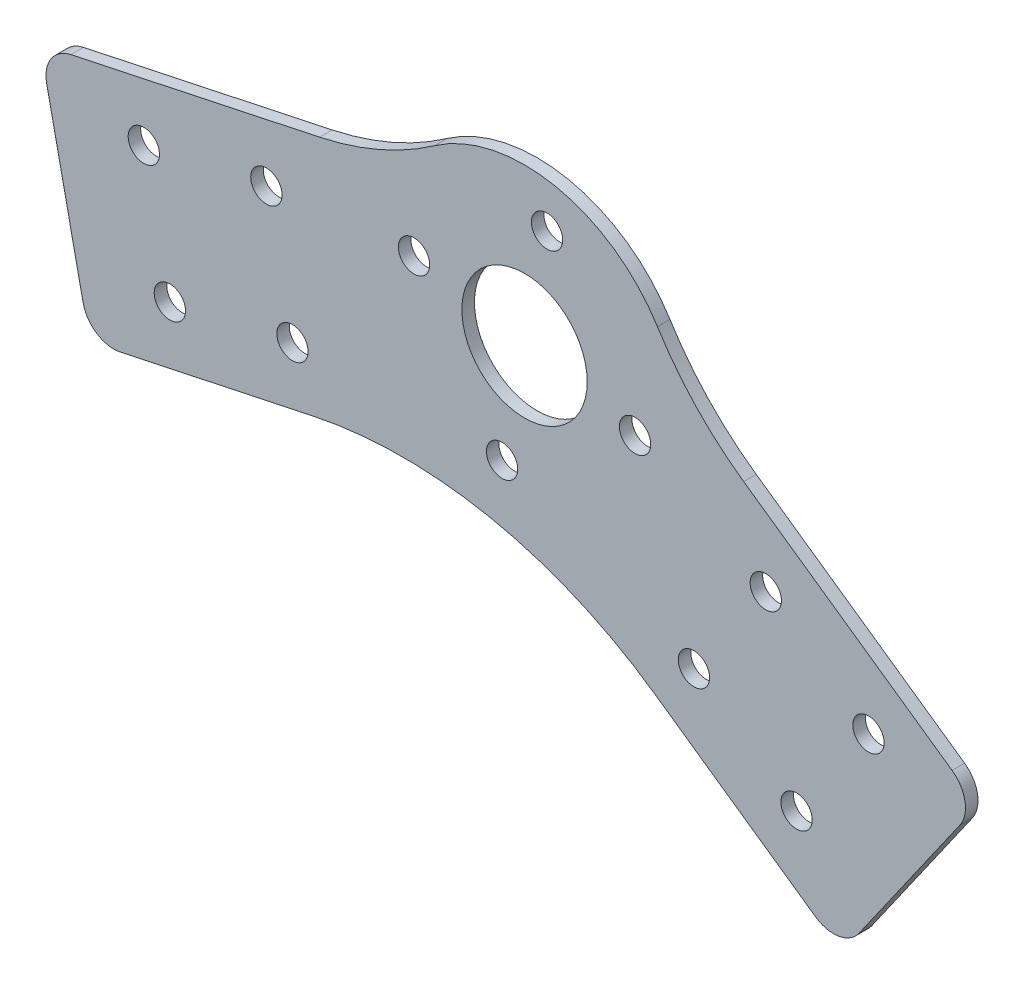
ISO-10303-21;
HEADER;
FILE_DESCRIPTION(('STEP AP214'),'2;1');
FILE_NAME('part.step','',(''),(''),'','','');
FILE_SCHEMA(('AUTOMOTIVE_DESIGN { 1 0 10303 214 1 1 1 1 }'));
ENDSEC;
DATA;
#1=APPLICATION_CONTEXT('core data for automotive mechanical design processes');
#2=APPLICATION_PROTOCOL_DEFINITION('international standard','automotive_design',2000,#1);
#3=PRODUCT_CONTEXT('',#1,'mechanical');
#4=PRODUCT('Part','Part','',(#3));
#5=PRODUCT_RELATED_PRODUCT_CATEGORY('part','',(#4));
#6=PRODUCT_DEFINITION_FORMATION('','',#4);
#7=PRODUCT_DEFINITION_CONTEXT('part definition',#1,'design');
#8=PRODUCT_DEFINITION('design','',#6,#7);
#9=PRODUCT_DEFINITION_SHAPE('','',#8);
#10=(LENGTH_UNIT() NAMED_UNIT(*) SI_UNIT(.MILLI.,.METRE.));
#11=(NAMED_UNIT(*) PLANE_ANGLE_UNIT() SI_UNIT($,.RADIAN.));
#12=(NAMED_UNIT(*) SI_UNIT($,.STERADIAN.) SOLID_ANGLE_UNIT());
#13=UNCERTAINTY_MEASURE_WITH_UNIT(LENGTH_MEASURE(1.E-05),#10,'distance_accuracy_value','');
#14=(GEOMETRIC_REPRESENTATION_CONTEXT(3) GLOBAL_UNCERTAINTY_ASSIGNED_CONTEXT((#13)) GLOBAL_UNIT_ASSIGNED_CONTEXT((#10,
#11,#12)) REPRESENTATION_CONTEXT('',''));
#15=CARTESIAN_POINT('',(0.,0.,0.));
#16=DIRECTION('',(0.,0.,1.));
#17=DIRECTION('',(1.,0.,0.));
#18=AXIS2_PLACEMENT_3D('',#15,#16,#17);
#19=CARTESIAN_POINT('',(0.,0.,2.));
#20=DIRECTION('',(0.,0.,1.));
#21=DIRECTION('',(1.,0.,0.));
#22=AXIS2_PLACEMENT_3D('',#19,#20,#21);
#23=PLANE('',#22);
#24=CARTESIAN_POINT('',(3.5886228195096,17.6386446831749,2.));
#25=DIRECTION('',(0.,0.,1.));
#26=DIRECTION('',(1.,0.,0.));
#27=AXIS2_PLACEMENT_3D('',#24,#25,#26);
#28=CIRCLE('',#27,2.5);
#29=CARTESIAN_POINT('',(6.0886228195096,17.6386446831749,2.));
#30=VERTEX_POINT('',#29);
#31=EDGE_CURVE('E565',#30,#30,#28,.T.);
#32=ORIENTED_EDGE('',*,*,#31,.F.);
#33=EDGE_LOOP('',(#32));
#34=FACE_BOUND('',#33,.T.);
#35=CARTESIAN_POINT('',(17.6386446831753,-3.58862281950917,2.));
#36=DIRECTION('',(0.,0.,1.));
#37=DIRECTION('',(1.,0.,0.));
#38=AXIS2_PLACEMENT_3D('',#35,#36,#37);
#39=CIRCLE('',#38,2.5);
#40=CARTESIAN_POINT('',(20.1386446831753,-3.58862281950917,2.));
#41=VERTEX_POINT('',#40);
#42=EDGE_CURVE('E553',#41,#41,#39,.T.);
#43=ORIENTED_EDGE('',*,*,#42,.F.);
#44=EDGE_LOOP('',(#43));
#45=FACE_BOUND('',#44,.T.);
#46=CARTESIAN_POINT('',(54.8848870208499,-26.2230657381731,2.));
#47=DIRECTION('',(0.,0.,1.));
#48=DIRECTION('',(-1.,0.,0.));
#49=AXIS2_PLACEMENT_3D('',#46,#47,#48);
#50=CIRCLE('',#49,2.49999999999999);
#51=CARTESIAN_POINT('',(52.3848870208499,-26.2230657381731,2.));
#52=VERTEX_POINT('',#51);
#53=EDGE_CURVE('E541',#52,#52,#50,.T.);
#54=ORIENTED_EDGE('',*,*,#53,.F.);
#55=EDGE_LOOP('',(#54));
#56=FACE_BOUND('',#55,.T.);
#57=CARTESIAN_POINT('',(27.0303174080491,-31.1345778969319,2.));
#58=DIRECTION('',(0.,0.,1.));
#59=DIRECTION('',(-1.,0.,0.));
#60=AXIS2_PLACEMENT_3D('',#57,#58,#59);
#61=CIRCLE('',#60,2.5);
#62=CARTESIAN_POINT('',(24.5303174080491,-31.1345778969319,2.));
#63=VERTEX_POINT('',#62);
#64=EDGE_CURVE('E529',#63,#63,#61,.T.);
#65=ORIENTED_EDGE('',*,*,#64,.F.);
#66=EDGE_LOOP('',(#65));
#67=FACE_BOUND('',#66,.T.);
#68=CARTESIAN_POINT('',(-41.2050209375298,1.4650083746278,2.));
#69=DIRECTION('',(0.,0.,1.));
#70=DIRECTION('',(-1.,0.,0.));
#71=AXIS2_PLACEMENT_3D('',#68,#69,#70);
#72=CIRCLE('',#71,2.50000000000001);
#73=CARTESIAN_POINT('',(-43.7050209375298,1.4650083746278,2.));
#74=VERTEX_POINT('',#73);
#75=EDGE_CURVE('E517',#74,#74,#72,.T.);
#76=ORIENTED_EDGE('',*,*,#75,.F.);
#77=EDGE_LOOP('',(#76));
#78=FACE_BOUND('',#77,.T.);
#79=CARTESIAN_POINT('',(-56.6097391358508,-22.2561774564035,2.));
#80=DIRECTION('',(0.,0.,1.));
#81=DIRECTION('',(-1.,0.,0.));
#82=AXIS2_PLACEMENT_3D('',#79,#80,#81);
#83=CIRCLE('',#82,2.49999999999999);
#84=CARTESIAN_POINT('',(-59.1097391358508,-22.2561774564035,2.));
#85=VERTEX_POINT('',#84);
#86=EDGE_CURVE('E460',#85,#85,#83,.T.);
#87=ORIENTED_EDGE('',*,*,#86,.F.);
#88=EDGE_LOOP('',(#87));
#89=FACE_BOUND('',#88,.T.);
#90=DIRECTION('',(0.57357643635105,0.819152044288989,0.));
#91=VECTOR('',#90,1.);
#92=CARTESIAN_POINT('',(50.5384510310042,-58.5821215678195,2.));
#93=LINE('',#92,#91);
#94=CARTESIAN_POINT('',(53.4063332127595,-54.4863613463746,2.));
#95=VERTEX_POINT('',#94);
#96=CARTESIAN_POINT('',(69.4664734305889,-31.5501041062829,2.));
#97=VERTEX_POINT('',#96);
#98=EDGE_CURVE('E269',#95,#97,#93,.T.);
#99=ORIENTED_EDGE('',*,*,#98,.T.);
#100=CARTESIAN_POINT('',(65.3707132091439,-28.6822219245277,2.));
#101=DIRECTION('',(0.,0.,1.));
#102=DIRECTION('',(1.,0.,0.));
#103=AXIS2_PLACEMENT_3D('',#100,#101,#102);
#104=CIRCLE('',#103,5.);
#105=CARTESIAN_POINT('',(68.2385953908992,-24.5864617030827,2.));
#106=VERTEX_POINT('',#105);
#107=EDGE_CURVE('E235',#97,#106,#104,.T.);
#108=ORIENTED_EDGE('',*,*,#107,.T.);
#109=DIRECTION('',(-0.819152044288989,0.57357643635105,0.));
#110=VECTOR('',#109,1.);
#111=CARTESIAN_POINT('',(72.3343556123441,-27.454343884838,2.));
#112=LINE('',#111,#110);
#113=CARTESIAN_POINT('',(34.9760066538589,-1.29574632903747,2.));
#114=VERTEX_POINT('',#113);
#115=EDGE_CURVE('E271',#106,#114,#112,.T.);
#116=ORIENTED_EDGE('',*,*,#115,.T.);
#117=CARTESIAN_POINT('',(63.6548284714115,39.661855885412,2.));
#118=DIRECTION('',(0.,0.,1.));
#119=DIRECTION('',(1.,0.,0.));
#120=AXIS2_PLACEMENT_3D('',#117,#118,#119);
#121=CIRCLE('',#120,50.);
#122=CARTESIAN_POINT('',(21.2182761571371,13.2206186284707,2.));
#123=VERTEX_POINT('',#122);
#124=EDGE_CURVE('E202',#114,#123,#121,.F.);
#125=ORIENTED_EDGE('',*,*,#124,.T.);
#126=CARTESIAN_POINT('',(0.,0.,2.));
#127=DIRECTION('',(0.,0.,1.));
#128=DIRECTION('',(1.,0.,0.));
#129=AXIS2_PLACEMENT_3D('',#126,#127,#128);
#130=CIRCLE('',#129,25.);
#131=CARTESIAN_POINT('',(-14.3658189485101,20.4602846006263,2.));
#132=VERTEX_POINT('',#131);
#133=EDGE_CURVE('E164',#123,#132,#130,.T.);
#134=ORIENTED_EDGE('',*,*,#133,.T.);
#135=CARTESIAN_POINT('',(-43.0974568455304,61.380853801879,2.));
#136=DIRECTION('',(0.,0.,1.));
#137=DIRECTION('',(1.,0.,0.));
#138=AXIS2_PLACEMENT_3D('',#135,#136,#137);
#139=CIRCLE('',#138,50.);
#140=CARTESIAN_POINT('',(-32.7018723046426,12.4734737651887,2.));
#141=VERTEX_POINT('',#140);
#142=EDGE_CURVE('E152',#132,#141,#139,.F.);
#143=ORIENTED_EDGE('',*,*,#142,.T.);
#144=DIRECTION('',(-0.978147600733806,-0.207911690817757,0.));
#145=VECTOR('',#144,1.);
#146=CARTESIAN_POINT('',(-77.3113921805728,2.99142760261058,2.));
#147=LINE('',#146,#145);
#148=CARTESIAN_POINT('',(-72.4206541769038,4.03098605669936,2.));
#149=VERTEX_POINT('',#148);
#150=EDGE_CURVE('E162',#141,#149,#147,.T.);
#151=ORIENTED_EDGE('',*,*,#150,.T.);
#152=CARTESIAN_POINT('',(-71.381095722815,-0.859751946969668,2.));
#153=DIRECTION('',(0.,0.,1.));
#154=DIRECTION('',(1.,0.,0.));
#155=AXIS2_PLACEMENT_3D('',#152,#153,#154);
#156=CIRCLE('',#155,5.);
#157=CARTESIAN_POINT('',(-76.271833726484,-1.89931040105845,2.));
#158=VERTEX_POINT('',#157);
#159=EDGE_CURVE('E230',#149,#158,#156,.T.);
#160=ORIENTED_EDGE('',*,*,#159,.T.);
#161=DIRECTION('',(0.207911690817756,-0.978147600733806,0.));
#162=VECTOR('',#161,1.);
#163=CARTESIAN_POINT('',(-77.3113921805728,2.99142760261058,2.));
#164=LINE('',#163,#162);
#165=CARTESIAN_POINT('',(-70.4503063835869,-29.287443221605,2.));
#166=VERTEX_POINT('',#165);
#167=EDGE_CURVE('E247',#158,#166,#164,.T.);
#168=ORIENTED_EDGE('',*,*,#167,.T.);
#169=CARTESIAN_POINT('',(-65.5595683799178,-28.2478847675162,2.));
#170=DIRECTION('',(0.,0.,1.));
#171=DIRECTION('',(1.,0.,0.));
#172=AXIS2_PLACEMENT_3D('',#169,#170,#171);
#173=CIRCLE('',#172,5.);
#174=CARTESIAN_POINT('',(-64.520009925829,-33.1386227711853,2.));
#175=VERTEX_POINT('',#174);
#176=EDGE_CURVE('E62',#166,#175,#173,.T.);
#177=ORIENTED_EDGE('',*,*,#176,.T.);
#178=DIRECTION('',(0.978147600733806,0.207911690817757,0.));
#179=VECTOR('',#178,1.);
#180=CARTESIAN_POINT('',(-69.4107479294981,-34.1781812252741,2.));
#181=LINE('',#180,#179);
#182=CARTESIAN_POINT('',(-33.9023285134918,-26.6306336838708,2.));
#183=VERTEX_POINT('',#182);
#184=EDGE_CURVE('E253',#175,#183,#181,.T.);
#185=ORIENTED_EDGE('',*,*,#184,.T.);
#186=CARTESIAN_POINT('',(-19.3485101562488,-95.1009657352373,2.));
#187=DIRECTION('',(0.,0.,1.));
#188=DIRECTION('',(1.,0.,0.));
#189=AXIS2_PLACEMENT_3D('',#186,#187,#188);
#190=CIRCLE('',#189,70.);
#191=CARTESIAN_POINT('',(20.8018403883247,-37.760322635008,2.));
#192=VERTEX_POINT('',#191);
#193=EDGE_CURVE('E213',#183,#192,#190,.F.);
#194=ORIENTED_EDGE('',*,*,#193,.T.);
#195=DIRECTION('',(0.819152044288989,-0.57357643635105,0.));
#196=VECTOR('',#195,1.);
#197=CARTESIAN_POINT('',(-4.13058081987337,-20.3024533592079,2.));
#198=LINE('',#197,#196);
#199=CARTESIAN_POINT('',(46.4426908095593,-55.7142393860643,2.));
#200=VERTEX_POINT('',#199);
#201=EDGE_CURVE('E266',#192,#200,#198,.T.);
#202=ORIENTED_EDGE('',*,*,#201,.T.);
#203=CARTESIAN_POINT('',(49.3105729913146,-51.6184791646194,2.));
#204=DIRECTION('',(0.,0.,1.));
#205=DIRECTION('',(1.,0.,0.));
#206=AXIS2_PLACEMENT_3D('',#203,#204,#205);
#207=CIRCLE('',#206,5.);
#208=EDGE_CURVE('E233',#200,#95,#207,.T.);
#209=ORIENTED_EDGE('',*,*,#208,.T.);
#210=EDGE_LOOP('',(#99,#108,#116,#125,#134,#143,#151,#160,#168,#177,#185,#194,#202,#209));
#211=FACE_BOUND('',#210,.T.);
#212=CARTESIAN_POINT('',(-60.7679729522059,-2.69322544172733,2.));
#213=DIRECTION('',(0.,0.,1.));
#214=DIRECTION('',(1.,0.,0.));
#215=AXIS2_PLACEMENT_3D('',#212,#213,#214);
#216=CIRCLE('',#215,2.49999999999999);
#217=CARTESIAN_POINT('',(-58.2679729522059,-2.69322544172733,2.));
#218=VERTEX_POINT('',#217);
#219=EDGE_CURVE('E172',#218,#218,#216,.T.);
#220=ORIENTED_EDGE('',*,*,#219,.F.);
#221=EDGE_LOOP('',(#220));
#222=FACE_BOUND('',#221,.T.);
#223=CARTESIAN_POINT('',(-37.0467871211747,-18.0979436400483,2.));
#224=DIRECTION('',(0.,0.,1.));
#225=DIRECTION('',(1.,0.,0.));
#226=AXIS2_PLACEMENT_3D('',#223,#224,#225);
#227=CIRCLE('',#226,2.49999999999999);
#228=CARTESIAN_POINT('',(-34.5467871211747,-18.0979436400483,2.));
#229=VERTEX_POINT('',#228);
#230=EDGE_CURVE('E512',#229,#229,#227,.T.);
#231=ORIENTED_EDGE('',*,*,#230,.F.);
#232=EDGE_LOOP('',(#231));
#233=FACE_BOUND('',#232,.T.);
#234=CARTESIAN_POINT('',(38.5018461350701,-14.7515370111521,2.));
#235=DIRECTION('',(0.,0.,1.));
#236=DIRECTION('',(1.,0.,0.));
#237=AXIS2_PLACEMENT_3D('',#234,#235,#236);
#238=CIRCLE('',#237,2.5);
#239=CARTESIAN_POINT('',(41.0018461350701,-14.7515370111521,2.));
#240=VERTEX_POINT('',#239);
#241=EDGE_CURVE('E523',#240,#240,#238,.T.);
#242=ORIENTED_EDGE('',*,*,#241,.F.);
#243=EDGE_LOOP('',(#242));
#244=FACE_BOUND('',#243,.T.);
#245=CARTESIAN_POINT('',(43.4133582938288,-42.6061066239529,2.));
#246=DIRECTION('',(0.,0.,1.));
#247=DIRECTION('',(1.,0.,0.));
#248=AXIS2_PLACEMENT_3D('',#245,#246,#247);
#249=CIRCLE('',#248,2.5);
#250=CARTESIAN_POINT('',(45.9133582938288,-42.6061066239529,2.));
#251=VERTEX_POINT('',#250);
#252=EDGE_CURVE('E535',#251,#251,#249,.T.);
#253=ORIENTED_EDGE('',*,*,#252,.F.);
#254=EDGE_LOOP('',(#253));
#255=FACE_BOUND('',#254,.T.);
#256=CARTESIAN_POINT('',(0.,0.,2.));
#257=DIRECTION('',(0.,0.,1.));
#258=DIRECTION('',(1.,0.,0.));
#259=AXIS2_PLACEMENT_3D('',#256,#257,#258);
#260=CIRCLE('',#259,10.);
#261=CARTESIAN_POINT('',(10.,0.,2.));
#262=VERTEX_POINT('',#261);
#263=EDGE_CURVE('E547',#262,#262,#260,.T.);
#264=ORIENTED_EDGE('',*,*,#263,.F.);
#265=EDGE_LOOP('',(#264));
#266=FACE_BOUND('',#265,.T.);
#267=CARTESIAN_POINT('',(-3.58862281950875,-17.6386446831749,2.));
#268=DIRECTION('',(0.,0.,1.));
#269=DIRECTION('',(1.,0.,0.));
#270=AXIS2_PLACEMENT_3D('',#267,#268,#269);
#271=CIRCLE('',#270,2.5);
#272=CARTESIAN_POINT('',(-1.08862281950875,-17.6386446831749,2.));
#273=VERTEX_POINT('',#272);
#274=EDGE_CURVE('E559',#273,#273,#271,.T.);
#275=ORIENTED_EDGE('',*,*,#274,.F.);
#276=EDGE_LOOP('',(#275));
#277=FACE_BOUND('',#276,.T.);
#278=CARTESIAN_POINT('',(-17.6386446831745,3.58862281950917,2.));
#279=DIRECTION('',(0.,0.,1.));
#280=DIRECTION('',(1.,0.,0.));
#281=AXIS2_PLACEMENT_3D('',#278,#279,#280);
#282=CIRCLE('',#281,2.5);
#283=CARTESIAN_POINT('',(-15.1386446831745,3.58862281950917,2.));
#284=VERTEX_POINT('',#283);
#285=EDGE_CURVE('E571',#284,#284,#282,.T.);
#286=ORIENTED_EDGE('',*,*,#285,.F.);
#287=EDGE_LOOP('',(#286));
#288=FACE_BOUND('',#287,.T.);
#289=ADVANCED_FACE('F39',(#34,#45,#56,#67,#78,#89,#211,#222,#233,#244,#255,#266,#277,#288),#23,.T.);
#290=CARTESIAN_POINT('',(0.,0.,0.));
#291=DIRECTION('',(0.,0.,1.));
#292=DIRECTION('',(1.,0.,0.));
#293=AXIS2_PLACEMENT_3D('',#290,#291,#292);
#294=PLANE('',#293);
#295=DIRECTION('',(-0.819152044288989,0.57357643635105,0.));
#296=VECTOR('',#295,1.);
#297=CARTESIAN_POINT('',(72.3343556123441,-27.454343884838,0.));
#298=LINE('',#297,#296);
#299=CARTESIAN_POINT('',(68.2385953908992,-24.5864617030827,0.));
#300=VERTEX_POINT('',#299);
#301=CARTESIAN_POINT('',(34.9760066538589,-1.29574632903747,0.));
#302=VERTEX_POINT('',#301);
#303=EDGE_CURVE('E189',#300,#302,#298,.T.);
#304=ORIENTED_EDGE('',*,*,#303,.F.);
#305=CARTESIAN_POINT('',(65.3707132091439,-28.6822219245277,0.));
#306=DIRECTION('',(0.,0.,1.));
#307=DIRECTION('',(1.,0.,0.));
#308=AXIS2_PLACEMENT_3D('',#305,#306,#307);
#309=CIRCLE('',#308,5.);
#310=CARTESIAN_POINT('',(69.4664734305889,-31.5501041062829,0.));
#311=VERTEX_POINT('',#310);
#312=EDGE_CURVE('E223',#300,#311,#309,.F.);
#313=ORIENTED_EDGE('',*,*,#312,.T.);
#314=DIRECTION('',(0.57357643635105,0.819152044288989,0.));
#315=VECTOR('',#314,1.);
#316=CARTESIAN_POINT('',(50.5384510310042,-58.5821215678195,0.));
#317=LINE('',#316,#315);
#318=CARTESIAN_POINT('',(53.4063332127595,-54.4863613463746,0.));
#319=VERTEX_POINT('',#318);
#320=EDGE_CURVE('E186',#319,#311,#317,.T.);
#321=ORIENTED_EDGE('',*,*,#320,.F.);
#322=CARTESIAN_POINT('',(49.3105729913146,-51.6184791646194,0.));
#323=DIRECTION('',(0.,0.,1.));
#324=DIRECTION('',(1.,0.,0.));
#325=AXIS2_PLACEMENT_3D('',#322,#323,#324);
#326=CIRCLE('',#325,5.);
#327=CARTESIAN_POINT('',(46.4426908095593,-55.7142393860643,0.));
#328=VERTEX_POINT('',#327);
#329=EDGE_CURVE('E221',#319,#328,#326,.F.);
#330=ORIENTED_EDGE('',*,*,#329,.T.);
#331=DIRECTION('',(0.819152044288989,-0.57357643635105,0.));
#332=VECTOR('',#331,1.);
#333=CARTESIAN_POINT('',(-4.13058081987337,-20.3024533592079,0.));
#334=LINE('',#333,#332);
#335=CARTESIAN_POINT('',(20.8018403883247,-37.760322635008,0.));
#336=VERTEX_POINT('',#335);
#337=EDGE_CURVE('E184',#336,#328,#334,.T.);
#338=ORIENTED_EDGE('',*,*,#337,.F.);
#339=CARTESIAN_POINT('',(-19.3485101562488,-95.1009657352373,0.));
#340=DIRECTION('',(0.,0.,1.));
#341=DIRECTION('',(1.,0.,0.));
#342=AXIS2_PLACEMENT_3D('',#339,#340,#341);
#343=CIRCLE('',#342,70.);
#344=CARTESIAN_POINT('',(-33.9023285134918,-26.6306336838708,0.));
#345=VERTEX_POINT('',#344);
#346=EDGE_CURVE('E210',#336,#345,#343,.T.);
#347=ORIENTED_EDGE('',*,*,#346,.T.);
#348=DIRECTION('',(0.978147600733806,0.207911690817757,0.));
#349=VECTOR('',#348,1.);
#350=CARTESIAN_POINT('',(-69.4107479294981,-34.1781812252741,0.));
#351=LINE('',#350,#349);
#352=CARTESIAN_POINT('',(-64.520009925829,-33.1386227711853,0.));
#353=VERTEX_POINT('',#352);
#354=EDGE_CURVE('E175',#353,#345,#351,.T.);
#355=ORIENTED_EDGE('',*,*,#354,.F.);
#356=CARTESIAN_POINT('',(-65.5595683799178,-28.2478847675162,0.));
#357=DIRECTION('',(0.,0.,1.));
#358=DIRECTION('',(1.,0.,0.));
#359=AXIS2_PLACEMENT_3D('',#356,#357,#358);
#360=CIRCLE('',#359,5.);
#361=CARTESIAN_POINT('',(-70.4503063835869,-29.287443221605,0.));
#362=VERTEX_POINT('',#361);
#363=EDGE_CURVE('E219',#353,#362,#360,.F.);
#364=ORIENTED_EDGE('',*,*,#363,.T.);
#365=DIRECTION('',(0.207911690817756,-0.978147600733806,0.));
#366=VECTOR('',#365,1.);
#367=CARTESIAN_POINT('',(-77.3113921805728,2.99142760261058,0.));
#368=LINE('',#367,#366);
#369=CARTESIAN_POINT('',(-76.271833726484,-1.89931040105845,0.));
#370=VERTEX_POINT('',#369);
#371=EDGE_CURVE('E171',#370,#362,#368,.T.);
#372=ORIENTED_EDGE('',*,*,#371,.F.);
#373=CARTESIAN_POINT('',(-71.381095722815,-0.859751946969668,0.));
#374=DIRECTION('',(0.,0.,1.));
#375=DIRECTION('',(1.,0.,0.));
#376=AXIS2_PLACEMENT_3D('',#373,#374,#375);
#377=CIRCLE('',#376,5.);
#378=CARTESIAN_POINT('',(-72.4206541769038,4.03098605669936,0.));
#379=VERTEX_POINT('',#378);
#380=EDGE_CURVE('E170',#370,#379,#377,.F.);
#381=ORIENTED_EDGE('',*,*,#380,.T.);
#382=DIRECTION('',(-0.978147600733806,-0.207911690817757,0.));
#383=VECTOR('',#382,1.);
#384=CARTESIAN_POINT('',(-77.3113921805728,2.99142760261058,0.));
#385=LINE('',#384,#383);
#386=CARTESIAN_POINT('',(-32.7018723046426,12.4734737651887,0.));
#387=VERTEX_POINT('',#386);
#388=EDGE_CURVE('E159',#387,#379,#385,.T.);
#389=ORIENTED_EDGE('',*,*,#388,.F.);
#390=CARTESIAN_POINT('',(-43.0974568455304,61.380853801879,0.));
#391=DIRECTION('',(0.,0.,1.));
#392=DIRECTION('',(1.,0.,0.));
#393=AXIS2_PLACEMENT_3D('',#390,#391,#392);
#394=CIRCLE('',#393,50.);
#395=CARTESIAN_POINT('',(-14.3658189485101,20.4602846006263,0.));
#396=VERTEX_POINT('',#395);
#397=EDGE_CURVE('E142',#387,#396,#394,.T.);
#398=ORIENTED_EDGE('',*,*,#397,.T.);
#399=CARTESIAN_POINT('',(0.,0.,0.));
#400=DIRECTION('',(0.,0.,1.));
#401=DIRECTION('',(1.,0.,0.));
#402=AXIS2_PLACEMENT_3D('',#399,#400,#401);
#403=CIRCLE('',#402,25.);
#404=CARTESIAN_POINT('',(21.2182761571371,13.2206186284707,0.));
#405=VERTEX_POINT('',#404);
#406=EDGE_CURVE('E191',#405,#396,#403,.T.);
#407=ORIENTED_EDGE('',*,*,#406,.F.);
#408=CARTESIAN_POINT('',(63.6548284714115,39.661855885412,0.));
#409=DIRECTION('',(0.,0.,1.));
#410=DIRECTION('',(1.,0.,0.));
#411=AXIS2_PLACEMENT_3D('',#408,#409,#410);
#412=CIRCLE('',#411,50.);
#413=EDGE_CURVE('E199',#405,#302,#412,.T.);
#414=ORIENTED_EDGE('',*,*,#413,.T.);
#415=EDGE_LOOP('',(#304,#313,#321,#330,#338,#347,#355,#364,#372,#381,#389,#398,#407,#414));
#416=FACE_BOUND('',#415,.T.);
#417=CARTESIAN_POINT('',(-60.7679729522059,-2.69322544172733,0.));
#418=DIRECTION('',(0.,0.,1.));
#419=DIRECTION('',(1.,0.,0.));
#420=AXIS2_PLACEMENT_3D('',#417,#418,#419);
#421=CIRCLE('',#420,2.49999999999999);
#422=CARTESIAN_POINT('',(-58.2679729522059,-2.69322544172733,0.));
#423=VERTEX_POINT('',#422);
#424=EDGE_CURVE('E178',#423,#423,#421,.T.);
#425=ORIENTED_EDGE('',*,*,#424,.T.);
#426=EDGE_LOOP('',(#425));
#427=FACE_BOUND('',#426,.T.);
#428=CARTESIAN_POINT('',(-56.6097391358508,-22.2561774564035,0.));
#429=DIRECTION('',(0.,0.,1.));
#430=DIRECTION('',(-1.,0.,0.));
#431=AXIS2_PLACEMENT_3D('',#428,#429,#430);
#432=CIRCLE('',#431,2.49999999999999);
#433=CARTESIAN_POINT('',(-59.1097391358508,-22.2561774564035,0.));
#434=VERTEX_POINT('',#433);
#435=EDGE_CURVE('E463',#434,#434,#432,.T.);
#436=ORIENTED_EDGE('',*,*,#435,.T.);
#437=EDGE_LOOP('',(#436));
#438=FACE_BOUND('',#437,.T.);
#439=CARTESIAN_POINT('',(-37.0467871211747,-18.0979436400483,0.));
#440=DIRECTION('',(0.,0.,1.));
#441=DIRECTION('',(1.,0.,0.));
#442=AXIS2_PLACEMENT_3D('',#439,#440,#441);
#443=CIRCLE('',#442,2.49999999999999);
#444=CARTESIAN_POINT('',(-34.5467871211747,-18.0979436400483,0.));
#445=VERTEX_POINT('',#444);
#446=EDGE_CURVE('E514',#445,#445,#443,.T.);
#447=ORIENTED_EDGE('',*,*,#446,.T.);
#448=EDGE_LOOP('',(#447));
#449=FACE_BOUND('',#448,.T.);
#450=CARTESIAN_POINT('',(-41.2050209375298,1.4650083746278,0.));
#451=DIRECTION('',(0.,0.,1.));
#452=DIRECTION('',(-1.,0.,0.));
#453=AXIS2_PLACEMENT_3D('',#450,#451,#452);
#454=CIRCLE('',#453,2.50000000000001);
#455=CARTESIAN_POINT('',(-43.7050209375298,1.4650083746278,0.));
#456=VERTEX_POINT('',#455);
#457=EDGE_CURVE('E520',#456,#456,#454,.T.);
#458=ORIENTED_EDGE('',*,*,#457,.T.);
#459=EDGE_LOOP('',(#458));
#460=FACE_BOUND('',#459,.T.);
#461=CARTESIAN_POINT('',(38.5018461350701,-14.7515370111521,0.));
#462=DIRECTION('',(0.,0.,1.));
#463=DIRECTION('',(1.,0.,0.));
#464=AXIS2_PLACEMENT_3D('',#461,#462,#463);
#465=CIRCLE('',#464,2.5);
#466=CARTESIAN_POINT('',(41.0018461350701,-14.7515370111521,0.));
#467=VERTEX_POINT('',#466);
#468=EDGE_CURVE('E526',#467,#467,#465,.T.);
#469=ORIENTED_EDGE('',*,*,#468,.T.);
#470=EDGE_LOOP('',(#469));
#471=FACE_BOUND('',#470,.T.);
#472=CARTESIAN_POINT('',(27.0303174080491,-31.1345778969319,0.));
#473=DIRECTION('',(0.,0.,1.));
#474=DIRECTION('',(-1.,0.,0.));
#475=AXIS2_PLACEMENT_3D('',#472,#473,#474);
#476=CIRCLE('',#475,2.5);
#477=CARTESIAN_POINT('',(24.5303174080491,-31.1345778969319,0.));
#478=VERTEX_POINT('',#477);
#479=EDGE_CURVE('E532',#478,#478,#476,.T.);
#480=ORIENTED_EDGE('',*,*,#479,.T.);
#481=EDGE_LOOP('',(#480));
#482=FACE_BOUND('',#481,.T.);
#483=CARTESIAN_POINT('',(43.4133582938288,-42.6061066239529,0.));
#484=DIRECTION('',(0.,0.,1.));
#485=DIRECTION('',(1.,0.,0.));
#486=AXIS2_PLACEMENT_3D('',#483,#484,#485);
#487=CIRCLE('',#486,2.5);
#488=CARTESIAN_POINT('',(45.9133582938288,-42.6061066239529,0.));
#489=VERTEX_POINT('',#488);
#490=EDGE_CURVE('E538',#489,#489,#487,.T.);
#491=ORIENTED_EDGE('',*,*,#490,.T.);
#492=EDGE_LOOP('',(#491));
#493=FACE_BOUND('',#492,.T.);
#494=CARTESIAN_POINT('',(54.8848870208499,-26.2230657381731,0.));
#495=DIRECTION('',(0.,0.,1.));
#496=DIRECTION('',(-1.,0.,0.));
#497=AXIS2_PLACEMENT_3D('',#494,#495,#496);
#498=CIRCLE('',#497,2.49999999999999);
#499=CARTESIAN_POINT('',(52.3848870208499,-26.2230657381731,0.));
#500=VERTEX_POINT('',#499);
#501=EDGE_CURVE('E544',#500,#500,#498,.T.);
#502=ORIENTED_EDGE('',*,*,#501,.T.);
#503=EDGE_LOOP('',(#502));
#504=FACE_BOUND('',#503,.T.);
#505=CARTESIAN_POINT('',(0.,0.,0.));
#506=DIRECTION('',(0.,0.,1.));
#507=DIRECTION('',(1.,0.,0.));
#508=AXIS2_PLACEMENT_3D('',#505,#506,#507);
#509=CIRCLE('',#508,10.);
#510=CARTESIAN_POINT('',(10.,0.,0.));
#511=VERTEX_POINT('',#510);
#512=EDGE_CURVE('E550',#511,#511,#509,.T.);
#513=ORIENTED_EDGE('',*,*,#512,.T.);
#514=EDGE_LOOP('',(#513));
#515=FACE_BOUND('',#514,.T.);
#516=CARTESIAN_POINT('',(17.6386446831753,-3.58862281950917,0.));
#517=DIRECTION('',(0.,0.,1.));
#518=DIRECTION('',(1.,0.,0.));
#519=AXIS2_PLACEMENT_3D('',#516,#517,#518);
#520=CIRCLE('',#519,2.5);
#521=CARTESIAN_POINT('',(20.1386446831753,-3.58862281950917,0.));
#522=VERTEX_POINT('',#521);
#523=EDGE_CURVE('E556',#522,#522,#520,.T.);
#524=ORIENTED_EDGE('',*,*,#523,.T.);
#525=EDGE_LOOP('',(#524));
#526=FACE_BOUND('',#525,.T.);
#527=CARTESIAN_POINT('',(-3.58862281950875,-17.6386446831749,0.));
#528=DIRECTION('',(0.,0.,1.));
#529=DIRECTION('',(1.,0.,0.));
#530=AXIS2_PLACEMENT_3D('',#527,#528,#529);
#531=CIRCLE('',#530,2.5);
#532=CARTESIAN_POINT('',(-1.08862281950875,-17.6386446831749,0.));
#533=VERTEX_POINT('',#532);
#534=EDGE_CURVE('E562',#533,#533,#531,.T.);
#535=ORIENTED_EDGE('',*,*,#534,.T.);
#536=EDGE_LOOP('',(#535));
#537=FACE_BOUND('',#536,.T.);
#538=CARTESIAN_POINT('',(3.5886228195096,17.6386446831749,0.));
#539=DIRECTION('',(0.,0.,1.));
#540=DIRECTION('',(1.,0.,0.));
#541=AXIS2_PLACEMENT_3D('',#538,#539,#540);
#542=CIRCLE('',#541,2.5);
#543=CARTESIAN_POINT('',(6.0886228195096,17.6386446831749,0.));
#544=VERTEX_POINT('',#543);
#545=EDGE_CURVE('E568',#544,#544,#542,.T.);
#546=ORIENTED_EDGE('',*,*,#545,.T.);
#547=EDGE_LOOP('',(#546));
#548=FACE_BOUND('',#547,.T.);
#549=CARTESIAN_POINT('',(-17.6386446831745,3.58862281950917,0.));
#550=DIRECTION('',(0.,0.,1.));
#551=DIRECTION('',(1.,0.,0.));
#552=AXIS2_PLACEMENT_3D('',#549,#550,#551);
#553=CIRCLE('',#552,2.5);
#554=CARTESIAN_POINT('',(-15.1386446831745,3.58862281950917,0.));
#555=VERTEX_POINT('',#554);
#556=EDGE_CURVE('E574',#555,#555,#553,.T.);
#557=ORIENTED_EDGE('',*,*,#556,.T.);
#558=EDGE_LOOP('',(#557));
#559=FACE_BOUND('',#558,.T.);
#560=ADVANCED_FACE('F167',(#416,#427,#438,#449,#460,#471,#482,#493,#504,#515,#526,#537,#548,
#559),#294,.F.);
#561=CARTESIAN_POINT('',(-77.3113921805728,2.99142760261058,2.));
#562=DIRECTION('',(0.207911690817757,-0.978147600733806,0.));
#563=DIRECTION('',(0.978147600733806,0.207911690817757,0.));
#564=AXIS2_PLACEMENT_3D('',#561,#562,#563);
#565=PLANE('',#564);
#566=ORIENTED_EDGE('',*,*,#388,.T.);
#567=DIRECTION('',(0.,0.,-1.));
#568=VECTOR('',#567,1.);
#569=CARTESIAN_POINT('',(-72.4206541769038,4.03098605669936,2.));
#570=LINE('',#569,#568);
#571=EDGE_CURVE('E11',#379,#149,#570,.F.);
#572=ORIENTED_EDGE('',*,*,#571,.T.);
#573=ORIENTED_EDGE('',*,*,#150,.F.);
#574=DIRECTION('',(0.,0.,1.));
#575=VECTOR('',#574,1.);
#576=CARTESIAN_POINT('',(-32.7018723046426,12.4734737651887,0.));
#577=LINE('',#576,#575);
#578=EDGE_CURVE('E146',#141,#387,#577,.F.);
#579=ORIENTED_EDGE('',*,*,#578,.T.);
#580=EDGE_LOOP('',(#566,#572,#573,#579));
#581=FACE_BOUND('',#580,.T.);
#582=ADVANCED_FACE('F158',(#581),#565,.F.);
#583=CARTESIAN_POINT('',(-77.3113921805728,2.99142760261058,2.));
#584=DIRECTION('',(0.978147600733806,0.207911690817756,0.));
#585=DIRECTION('',(-0.207911690817756,0.978147600733806,0.));
#586=AXIS2_PLACEMENT_3D('',#583,#584,#585);
#587=PLANE('',#586);
#588=ORIENTED_EDGE('',*,*,#371,.T.);
#589=DIRECTION('',(0.,0.,-1.));
#590=VECTOR('',#589,1.);
#591=CARTESIAN_POINT('',(-70.4503063835869,-29.287443221605,2.));
#592=LINE('',#591,#590);
#593=EDGE_CURVE('E47',#362,#166,#592,.F.);
#594=ORIENTED_EDGE('',*,*,#593,.T.);
#595=ORIENTED_EDGE('',*,*,#167,.F.);
#596=DIRECTION('',(0.,0.,-1.));
#597=VECTOR('',#596,1.);
#598=CARTESIAN_POINT('',(-76.271833726484,-1.89931040105845,2.));
#599=LINE('',#598,#597);
#600=EDGE_CURVE('E241',#158,#370,#599,.T.);
#601=ORIENTED_EDGE('',*,*,#600,.T.);
#602=EDGE_LOOP('',(#588,#594,#595,#601));
#603=FACE_BOUND('',#602,.T.);
#604=ADVANCED_FACE('F246',(#603),#587,.F.);
#605=CARTESIAN_POINT('',(-69.4107479294981,-34.1781812252741,2.));
#606=DIRECTION('',(-0.207911690817757,0.978147600733806,0.));
#607=DIRECTION('',(-0.978147600733806,-0.207911690817757,0.));
#608=AXIS2_PLACEMENT_3D('',#605,#606,#607);
#609=PLANE('',#608);
#610=ORIENTED_EDGE('',*,*,#184,.F.);
#611=DIRECTION('',(0.,0.,-1.));
#612=VECTOR('',#611,1.);
#613=CARTESIAN_POINT('',(-64.520009925829,-33.1386227711853,2.));
#614=LINE('',#613,#612);
#615=EDGE_CURVE('E238',#175,#353,#614,.T.);
#616=ORIENTED_EDGE('',*,*,#615,.T.);
#617=ORIENTED_EDGE('',*,*,#354,.T.);
#618=DIRECTION('',(0.,0.,-1.));
#619=VECTOR('',#618,1.);
#620=CARTESIAN_POINT('',(-33.9023285134918,-26.6306336838708,2.));
#621=LINE('',#620,#619);
#622=EDGE_CURVE('E207',#345,#183,#621,.F.);
#623=ORIENTED_EDGE('',*,*,#622,.T.);
#624=EDGE_LOOP('',(#610,#616,#617,#623));
#625=FACE_BOUND('',#624,.T.);
#626=ADVANCED_FACE('F259',(#625),#609,.F.);
#627=CARTESIAN_POINT('',(-4.13058081987337,-20.3024533592079,2.));
#628=DIRECTION('',(0.57357643635105,0.819152044288989,0.));
#629=DIRECTION('',(-0.819152044288989,0.57357643635105,0.));
#630=AXIS2_PLACEMENT_3D('',#627,#628,#629);
#631=PLANE('',#630);
#632=ORIENTED_EDGE('',*,*,#337,.T.);
#633=DIRECTION('',(0.,0.,-1.));
#634=VECTOR('',#633,1.);
#635=CARTESIAN_POINT('',(46.4426908095593,-55.7142393860643,2.));
#636=LINE('',#635,#634);
#637=EDGE_CURVE('E54',#328,#200,#636,.F.);
#638=ORIENTED_EDGE('',*,*,#637,.T.);
#639=ORIENTED_EDGE('',*,*,#201,.F.);
#640=DIRECTION('',(0.,0.,-1.));
#641=VECTOR('',#640,1.);
#642=CARTESIAN_POINT('',(20.8018403883247,-37.760322635008,0.));
#643=LINE('',#642,#641);
#644=EDGE_CURVE('E204',#192,#336,#643,.T.);
#645=ORIENTED_EDGE('',*,*,#644,.T.);
#646=EDGE_LOOP('',(#632,#638,#639,#645));
#647=FACE_BOUND('',#646,.T.);
#648=ADVANCED_FACE('F268',(#647),#631,.F.);
#649=CARTESIAN_POINT('',(50.5384510310042,-58.5821215678195,2.));
#650=DIRECTION('',(-0.819152044288989,0.57357643635105,0.));
#651=DIRECTION('',(-0.57357643635105,-0.819152044288989,0.));
#652=AXIS2_PLACEMENT_3D('',#649,#650,#651);
#653=PLANE('',#652);
#654=ORIENTED_EDGE('',*,*,#320,.T.);
#655=DIRECTION('',(0.,0.,-1.));
#656=VECTOR('',#655,1.);
#657=CARTESIAN_POINT('',(69.4664734305889,-31.5501041062829,2.));
#658=LINE('',#657,#656);
#659=EDGE_CURVE('E228',#311,#97,#658,.F.);
#660=ORIENTED_EDGE('',*,*,#659,.T.);
#661=ORIENTED_EDGE('',*,*,#98,.F.);
#662=DIRECTION('',(0.,0.,-1.));
#663=VECTOR('',#662,1.);
#664=CARTESIAN_POINT('',(53.4063332127595,-54.4863613463746,2.));
#665=LINE('',#664,#663);
#666=EDGE_CURVE('E225',#95,#319,#665,.T.);
#667=ORIENTED_EDGE('',*,*,#666,.T.);
#668=EDGE_LOOP('',(#654,#660,#661,#667));
#669=FACE_BOUND('',#668,.T.);
#670=ADVANCED_FACE('F294',(#669),#653,.F.);
#671=CARTESIAN_POINT('',(72.3343556123441,-27.454343884838,2.));
#672=DIRECTION('',(-0.57357643635105,-0.819152044288989,0.));
#673=DIRECTION('',(0.819152044288989,-0.57357643635105,0.));
#674=AXIS2_PLACEMENT_3D('',#671,#672,#673);
#675=PLANE('',#674);
#676=ORIENTED_EDGE('',*,*,#115,.F.);
#677=DIRECTION('',(0.,0.,-1.));
#678=VECTOR('',#677,1.);
#679=CARTESIAN_POINT('',(68.2385953908992,-24.5864617030827,2.));
#680=LINE('',#679,#678);
#681=EDGE_CURVE('E215',#106,#300,#680,.T.);
#682=ORIENTED_EDGE('',*,*,#681,.T.);
#683=ORIENTED_EDGE('',*,*,#303,.T.);
#684=DIRECTION('',(0.,0.,1.));
#685=VECTOR('',#684,1.);
#686=CARTESIAN_POINT('',(34.9760066538589,-1.29574632903748,2.));
#687=LINE('',#686,#685);
#688=EDGE_CURVE('E153',#302,#114,#687,.T.);
#689=ORIENTED_EDGE('',*,*,#688,.T.);
#690=EDGE_LOOP('',(#676,#682,#683,#689));
#691=FACE_BOUND('',#690,.T.);
#692=ADVANCED_FACE('F286',(#691),#675,.F.);
#693=CARTESIAN_POINT('',(0.,0.,2.));
#694=DIRECTION('',(0.,0.,-1.));
#695=DIRECTION('',(-1.,0.,0.));
#696=AXIS2_PLACEMENT_3D('',#693,#694,#695);
#697=CYLINDRICAL_SURFACE('',#696,25.);
#698=ORIENTED_EDGE('',*,*,#406,.T.);
#699=DIRECTION('',(0.,0.,-1.));
#700=VECTOR('',#699,1.);
#701=CARTESIAN_POINT('',(-14.3658189485101,20.4602846006263,2.));
#702=LINE('',#701,#700);
#703=EDGE_CURVE('E147',#396,#132,#702,.F.);
#704=ORIENTED_EDGE('',*,*,#703,.T.);
#705=ORIENTED_EDGE('',*,*,#133,.F.);
#706=DIRECTION('',(0.,0.,-1.));
#707=VECTOR('',#706,1.);
#708=CARTESIAN_POINT('',(21.2182761571371,13.2206186284707,2.));
#709=LINE('',#708,#707);
#710=EDGE_CURVE('E163',#123,#405,#709,.T.);
#711=ORIENTED_EDGE('',*,*,#710,.T.);
#712=EDGE_LOOP('',(#698,#704,#705,#711));
#713=FACE_BOUND('',#712,.T.);
#714=ADVANCED_FACE('F280',(#713),#697,.T.);
#715=CARTESIAN_POINT('',(-60.7679729522059,-2.69322544172733,2.));
#716=DIRECTION('',(0.,0.,-1.));
#717=DIRECTION('',(-1.,0.,0.));
#718=AXIS2_PLACEMENT_3D('',#715,#716,#717);
#719=CYLINDRICAL_SURFACE('',#718,2.49999999999999);
#720=ORIENTED_EDGE('',*,*,#219,.T.);
#721=EDGE_LOOP('',(#720));
#722=FACE_BOUND('',#721,.T.);
#723=ORIENTED_EDGE('',*,*,#424,.F.);
#724=EDGE_LOOP('',(#723));
#725=FACE_BOUND('',#724,.T.);
#726=ADVANCED_FACE('F316',(#722,#725),#719,.F.);
#727=CARTESIAN_POINT('',(-56.6097391358508,-22.2561774564035,2.));
#728=DIRECTION('',(0.,0.,-1.));
#729=DIRECTION('',(-1.,0.,0.));
#730=AXIS2_PLACEMENT_3D('',#727,#728,#729);
#731=CYLINDRICAL_SURFACE('',#730,2.49999999999999);
#732=ORIENTED_EDGE('',*,*,#86,.T.);
#733=EDGE_LOOP('',(#732));
#734=FACE_BOUND('',#733,.T.);
#735=ORIENTED_EDGE('',*,*,#435,.F.);
#736=EDGE_LOOP('',(#735));
#737=FACE_BOUND('',#736,.T.);
#738=ADVANCED_FACE('F441',(#734,#737),#731,.F.);
#739=CARTESIAN_POINT('',(-37.0467871211747,-18.0979436400483,2.));
#740=DIRECTION('',(0.,0.,-1.));
#741=DIRECTION('',(-1.,0.,0.));
#742=AXIS2_PLACEMENT_3D('',#739,#740,#741);
#743=CYLINDRICAL_SURFACE('',#742,2.49999999999999);
#744=ORIENTED_EDGE('',*,*,#230,.T.);
#745=EDGE_LOOP('',(#744));
#746=FACE_BOUND('',#745,.T.);
#747=ORIENTED_EDGE('',*,*,#446,.F.);
#748=EDGE_LOOP('',(#747));
#749=FACE_BOUND('',#748,.T.);
#750=ADVANCED_FACE('F433',(#746,#749),#743,.F.);
#751=CARTESIAN_POINT('',(-41.2050209375298,1.4650083746278,2.));
#752=DIRECTION('',(0.,0.,-1.));
#753=DIRECTION('',(-1.,0.,0.));
#754=AXIS2_PLACEMENT_3D('',#751,#752,#753);
#755=CYLINDRICAL_SURFACE('',#754,2.50000000000001);
#756=ORIENTED_EDGE('',*,*,#75,.T.);
#757=EDGE_LOOP('',(#756));
#758=FACE_BOUND('',#757,.T.);
#759=ORIENTED_EDGE('',*,*,#457,.F.);
#760=EDGE_LOOP('',(#759));
#761=FACE_BOUND('',#760,.T.);
#762=ADVANCED_FACE('F425',(#758,#761),#755,.F.);
#763=CARTESIAN_POINT('',(38.5018461350701,-14.7515370111521,2.));
#764=DIRECTION('',(0.,0.,-1.));
#765=DIRECTION('',(-1.,0.,0.));
#766=AXIS2_PLACEMENT_3D('',#763,#764,#765);
#767=CYLINDRICAL_SURFACE('',#766,2.5);
#768=ORIENTED_EDGE('',*,*,#241,.T.);
#769=EDGE_LOOP('',(#768));
#770=FACE_BOUND('',#769,.T.);
#771=ORIENTED_EDGE('',*,*,#468,.F.);
#772=EDGE_LOOP('',(#771));
#773=FACE_BOUND('',#772,.T.);
#774=ADVANCED_FACE('F417',(#770,#773),#767,.F.);
#775=CARTESIAN_POINT('',(27.0303174080491,-31.1345778969319,2.));
#776=DIRECTION('',(0.,0.,-1.));
#777=DIRECTION('',(-1.,0.,0.));
#778=AXIS2_PLACEMENT_3D('',#775,#776,#777);
#779=CYLINDRICAL_SURFACE('',#778,2.5);
#780=ORIENTED_EDGE('',*,*,#64,.T.);
#781=EDGE_LOOP('',(#780));
#782=FACE_BOUND('',#781,.T.);
#783=ORIENTED_EDGE('',*,*,#479,.F.);
#784=EDGE_LOOP('',(#783));
#785=FACE_BOUND('',#784,.T.);
#786=ADVANCED_FACE('F409',(#782,#785),#779,.F.);
#787=CARTESIAN_POINT('',(43.4133582938288,-42.6061066239529,2.));
#788=DIRECTION('',(0.,0.,-1.));
#789=DIRECTION('',(-1.,0.,0.));
#790=AXIS2_PLACEMENT_3D('',#787,#788,#789);
#791=CYLINDRICAL_SURFACE('',#790,2.5);
#792=ORIENTED_EDGE('',*,*,#252,.T.);
#793=EDGE_LOOP('',(#792));
#794=FACE_BOUND('',#793,.T.);
#795=ORIENTED_EDGE('',*,*,#490,.F.);
#796=EDGE_LOOP('',(#795));
#797=FACE_BOUND('',#796,.T.);
#798=ADVANCED_FACE('F401',(#794,#797),#791,.F.);
#799=CARTESIAN_POINT('',(54.8848870208499,-26.2230657381731,2.));
#800=DIRECTION('',(0.,0.,-1.));
#801=DIRECTION('',(-1.,0.,0.));
#802=AXIS2_PLACEMENT_3D('',#799,#800,#801);
#803=CYLINDRICAL_SURFACE('',#802,2.49999999999999);
#804=ORIENTED_EDGE('',*,*,#53,.T.);
#805=EDGE_LOOP('',(#804));
#806=FACE_BOUND('',#805,.T.);
#807=ORIENTED_EDGE('',*,*,#501,.F.);
#808=EDGE_LOOP('',(#807));
#809=FACE_BOUND('',#808,.T.);
#810=ADVANCED_FACE('F393',(#806,#809),#803,.F.);
#811=CARTESIAN_POINT('',(0.,0.,2.));
#812=DIRECTION('',(0.,0.,-1.));
#813=DIRECTION('',(-1.,0.,0.));
#814=AXIS2_PLACEMENT_3D('',#811,#812,#813);
#815=CYLINDRICAL_SURFACE('',#814,10.);
#816=ORIENTED_EDGE('',*,*,#263,.T.);
#817=EDGE_LOOP('',(#816));
#818=FACE_BOUND('',#817,.T.);
#819=ORIENTED_EDGE('',*,*,#512,.F.);
#820=EDGE_LOOP('',(#819));
#821=FACE_BOUND('',#820,.T.);
#822=ADVANCED_FACE('F385',(#818,#821),#815,.F.);
#823=CARTESIAN_POINT('',(17.6386446831753,-3.58862281950917,2.));
#824=DIRECTION('',(0.,0.,-1.));
#825=DIRECTION('',(-1.,0.,0.));
#826=AXIS2_PLACEMENT_3D('',#823,#824,#825);
#827=CYLINDRICAL_SURFACE('',#826,2.5);
#828=ORIENTED_EDGE('',*,*,#42,.T.);
#829=EDGE_LOOP('',(#828));
#830=FACE_BOUND('',#829,.T.);
#831=ORIENTED_EDGE('',*,*,#523,.F.);
#832=EDGE_LOOP('',(#831));
#833=FACE_BOUND('',#832,.T.);
#834=ADVANCED_FACE('F377',(#830,#833),#827,.F.);
#835=CARTESIAN_POINT('',(-3.58862281950875,-17.6386446831749,2.));
#836=DIRECTION('',(0.,0.,-1.));
#837=DIRECTION('',(-1.,0.,0.));
#838=AXIS2_PLACEMENT_3D('',#835,#836,#837);
#839=CYLINDRICAL_SURFACE('',#838,2.5);
#840=ORIENTED_EDGE('',*,*,#274,.T.);
#841=EDGE_LOOP('',(#840));
#842=FACE_BOUND('',#841,.T.);
#843=ORIENTED_EDGE('',*,*,#534,.F.);
#844=EDGE_LOOP('',(#843));
#845=FACE_BOUND('',#844,.T.);
#846=ADVANCED_FACE('F369',(#842,#845),#839,.F.);
#847=CARTESIAN_POINT('',(3.5886228195096,17.6386446831749,2.));
#848=DIRECTION('',(0.,0.,-1.));
#849=DIRECTION('',(-1.,0.,0.));
#850=AXIS2_PLACEMENT_3D('',#847,#848,#849);
#851=CYLINDRICAL_SURFACE('',#850,2.5);
#852=ORIENTED_EDGE('',*,*,#31,.T.);
#853=EDGE_LOOP('',(#852));
#854=FACE_BOUND('',#853,.T.);
#855=ORIENTED_EDGE('',*,*,#545,.F.);
#856=EDGE_LOOP('',(#855));
#857=FACE_BOUND('',#856,.T.);
#858=ADVANCED_FACE('F361',(#854,#857),#851,.F.);
#859=CARTESIAN_POINT('',(-17.6386446831745,3.58862281950917,2.));
#860=DIRECTION('',(0.,0.,-1.));
#861=DIRECTION('',(-1.,0.,0.));
#862=AXIS2_PLACEMENT_3D('',#859,#860,#861);
#863=CYLINDRICAL_SURFACE('',#862,2.5);
#864=ORIENTED_EDGE('',*,*,#285,.T.);
#865=EDGE_LOOP('',(#864));
#866=FACE_BOUND('',#865,.T.);
#867=ORIENTED_EDGE('',*,*,#556,.F.);
#868=EDGE_LOOP('',(#867));
#869=FACE_BOUND('',#868,.T.);
#870=ADVANCED_FACE('F335',(#866,#869),#863,.F.);
#871=CARTESIAN_POINT('',(-43.0974568455304,61.380853801879,2.));
#872=DIRECTION('',(0.,0.,-1.));
#873=DIRECTION('',(-1.,0.,0.));
#874=AXIS2_PLACEMENT_3D('',#871,#872,#873);
#875=CYLINDRICAL_SURFACE('',#874,50.);
#876=ORIENTED_EDGE('',*,*,#142,.F.);
#877=ORIENTED_EDGE('',*,*,#703,.F.);
#878=ORIENTED_EDGE('',*,*,#397,.F.);
#879=ORIENTED_EDGE('',*,*,#578,.F.);
#880=EDGE_LOOP('',(#876,#877,#878,#879));
#881=FACE_BOUND('',#880,.T.);
#882=ADVANCED_FACE('F145',(#881),#875,.F.);
#883=CARTESIAN_POINT('',(63.6548284714115,39.661855885412,2.));
#884=DIRECTION('',(0.,0.,-1.));
#885=DIRECTION('',(-1.,0.,0.));
#886=AXIS2_PLACEMENT_3D('',#883,#884,#885);
#887=CYLINDRICAL_SURFACE('',#886,50.);
#888=ORIENTED_EDGE('',*,*,#124,.F.);
#889=ORIENTED_EDGE('',*,*,#688,.F.);
#890=ORIENTED_EDGE('',*,*,#413,.F.);
#891=ORIENTED_EDGE('',*,*,#710,.F.);
#892=EDGE_LOOP('',(#888,#889,#890,#891));
#893=FACE_BOUND('',#892,.T.);
#894=ADVANCED_FACE('F282',(#893),#887,.F.);
#895=CARTESIAN_POINT('',(-19.3485101562488,-95.1009657352373,2.));
#896=DIRECTION('',(0.,0.,1.));
#897=DIRECTION('',(1.,0.,0.));
#898=AXIS2_PLACEMENT_3D('',#895,#896,#897);
#899=CYLINDRICAL_SURFACE('',#898,70.);
#900=ORIENTED_EDGE('',*,*,#193,.F.);
#901=ORIENTED_EDGE('',*,*,#622,.F.);
#902=ORIENTED_EDGE('',*,*,#346,.F.);
#903=ORIENTED_EDGE('',*,*,#644,.F.);
#904=EDGE_LOOP('',(#900,#901,#902,#903));
#905=FACE_BOUND('',#904,.T.);
#906=ADVANCED_FACE('F265',(#905),#899,.F.);
#907=CARTESIAN_POINT('',(65.3707132091439,-28.6822219245277,2.));
#908=DIRECTION('',(0.,0.,-1.));
#909=DIRECTION('',(-1.,0.,0.));
#910=AXIS2_PLACEMENT_3D('',#907,#908,#909);
#911=CYLINDRICAL_SURFACE('',#910,5.);
#912=ORIENTED_EDGE('',*,*,#107,.F.);
#913=ORIENTED_EDGE('',*,*,#659,.F.);
#914=ORIENTED_EDGE('',*,*,#312,.F.);
#915=ORIENTED_EDGE('',*,*,#681,.F.);
#916=EDGE_LOOP('',(#912,#913,#914,#915));
#917=FACE_BOUND('',#916,.T.);
#918=ADVANCED_FACE('F290',(#917),#911,.T.);
#919=CARTESIAN_POINT('',(49.3105729913146,-51.6184791646194,2.));
#920=DIRECTION('',(0.,0.,-1.));
#921=DIRECTION('',(-1.,0.,0.));
#922=AXIS2_PLACEMENT_3D('',#919,#920,#921);
#923=CYLINDRICAL_SURFACE('',#922,5.);
#924=ORIENTED_EDGE('',*,*,#208,.F.);
#925=ORIENTED_EDGE('',*,*,#637,.F.);
#926=ORIENTED_EDGE('',*,*,#329,.F.);
#927=ORIENTED_EDGE('',*,*,#666,.F.);
#928=EDGE_LOOP('',(#924,#925,#926,#927));
#929=FACE_BOUND('',#928,.T.);
#930=ADVANCED_FACE('F297',(#929),#923,.T.);
#931=CARTESIAN_POINT('',(-65.5595683799178,-28.2478847675162,2.));
#932=DIRECTION('',(0.,0.,-1.));
#933=DIRECTION('',(-1.,0.,0.));
#934=AXIS2_PLACEMENT_3D('',#931,#932,#933);
#935=CYLINDRICAL_SURFACE('',#934,5.);
#936=ORIENTED_EDGE('',*,*,#176,.F.);
#937=ORIENTED_EDGE('',*,*,#593,.F.);
#938=ORIENTED_EDGE('',*,*,#363,.F.);
#939=ORIENTED_EDGE('',*,*,#615,.F.);
#940=EDGE_LOOP('',(#936,#937,#938,#939));
#941=FACE_BOUND('',#940,.T.);
#942=ADVANCED_FACE('F256',(#941),#935,.T.);
#943=CARTESIAN_POINT('',(-71.381095722815,-0.859751946969668,2.));
#944=DIRECTION('',(0.,0.,-1.));
#945=DIRECTION('',(-1.,0.,0.));
#946=AXIS2_PLACEMENT_3D('',#943,#944,#945);
#947=CYLINDRICAL_SURFACE('',#946,5.);
#948=ORIENTED_EDGE('',*,*,#159,.F.);
#949=ORIENTED_EDGE('',*,*,#571,.F.);
#950=ORIENTED_EDGE('',*,*,#380,.F.);
#951=ORIENTED_EDGE('',*,*,#600,.F.);
#952=EDGE_LOOP('',(#948,#949,#950,#951));
#953=FACE_BOUND('',#952,.T.);
#954=ADVANCED_FACE('F41',(#953),#947,.T.);
#955=CLOSED_SHELL('',(#289,#560,#582,#604,#626,#648,#670,#692,#714,#726,#738,#750,#762,#774,
#786,#798,#810,#822,#834,#846,#858,#870,#882,#894,#906,#918,#930,#942,#954));
#956=MANIFOLD_SOLID_BREP('B2',#955);
#957=ADVANCED_BREP_SHAPE_REPRESENTATION('',(#18,#956),#14);
#958=SHAPE_DEFINITION_REPRESENTATION(#9,#957);
ENDSEC;
END-ISO-10303-21;
